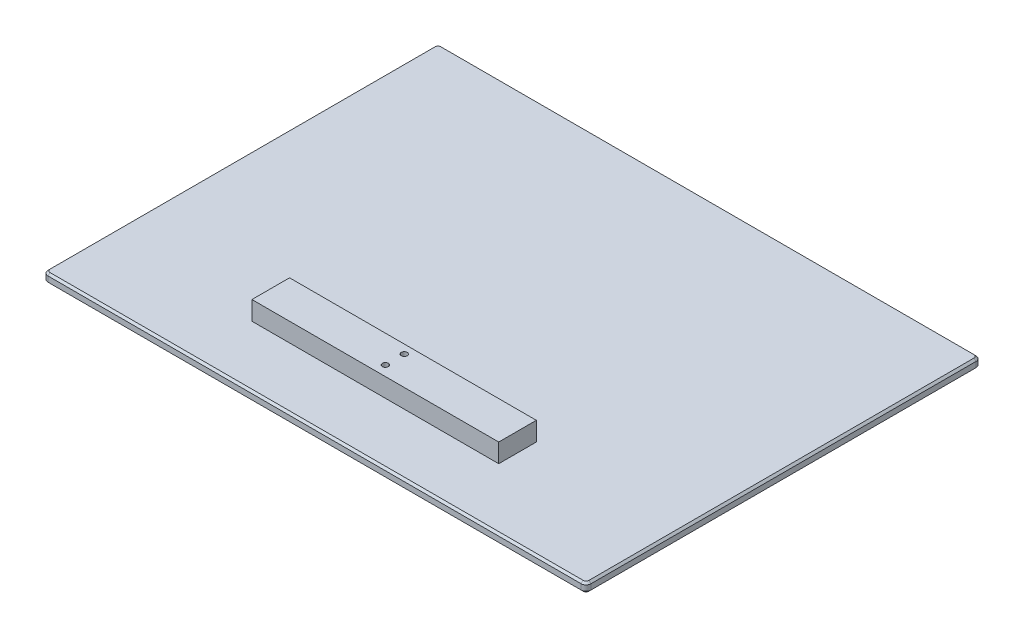
ISO-10303-21;
HEADER;
FILE_DESCRIPTION(('STEP AP214'),'2;1');
FILE_NAME('part.step','',(''),(''),'','','');
FILE_SCHEMA(('AUTOMOTIVE_DESIGN { 1 0 10303 214 1 1 1 1 }'));
ENDSEC;
DATA;
#1=APPLICATION_CONTEXT('core data for automotive mechanical design processes');
#2=APPLICATION_PROTOCOL_DEFINITION('international standard','automotive_design',2000,#1);
#3=PRODUCT_CONTEXT('',#1,'mechanical');
#4=PRODUCT('Part','Part','',(#3));
#5=PRODUCT_RELATED_PRODUCT_CATEGORY('part','',(#4));
#6=PRODUCT_DEFINITION_FORMATION('','',#4);
#7=PRODUCT_DEFINITION_CONTEXT('part definition',#1,'design');
#8=PRODUCT_DEFINITION('design','',#6,#7);
#9=PRODUCT_DEFINITION_SHAPE('','',#8);
#10=(LENGTH_UNIT() NAMED_UNIT(*) SI_UNIT(.MILLI.,.METRE.));
#11=(NAMED_UNIT(*) PLANE_ANGLE_UNIT() SI_UNIT($,.RADIAN.));
#12=(NAMED_UNIT(*) SI_UNIT($,.STERADIAN.) SOLID_ANGLE_UNIT());
#13=UNCERTAINTY_MEASURE_WITH_UNIT(LENGTH_MEASURE(1.E-05),#10,'distance_accuracy_value','');
#14=(GEOMETRIC_REPRESENTATION_CONTEXT(3) GLOBAL_UNCERTAINTY_ASSIGNED_CONTEXT((#13)) GLOBAL_UNIT_ASSIGNED_CONTEXT((#10,
#11,#12)) REPRESENTATION_CONTEXT('',''));
#15=CARTESIAN_POINT('',(0.,0.,0.));
#16=DIRECTION('',(0.,0.,1.));
#17=DIRECTION('',(1.,0.,0.));
#18=AXIS2_PLACEMENT_3D('',#15,#16,#17);
#19=CARTESIAN_POINT('',(275.,9.525,-200.));
#20=DIRECTION('',(-1.,0.,0.));
#21=DIRECTION('',(0.,0.,1.));
#22=AXIS2_PLACEMENT_3D('',#19,#20,#21);
#23=PLANE('',#22);
#24=DIRECTION('',(0.,-1.,0.));
#25=VECTOR('',#24,1.);
#26=CARTESIAN_POINT('',(275.,9.525,195.));
#27=LINE('',#26,#25);
#28=CARTESIAN_POINT('',(275.,7.52500000000005,195.));
#29=VERTEX_POINT('',#28);
#30=CARTESIAN_POINT('',(275.,1.99999999999995,195.));
#31=VERTEX_POINT('',#30);
#32=EDGE_CURVE('E216',#29,#31,#27,.T.);
#33=ORIENTED_EDGE('',*,*,#32,.T.);
#34=DIRECTION('',(0.,0.,-1.));
#35=VECTOR('',#34,1.);
#36=CARTESIAN_POINT('',(275.,1.99999999999995,-200.));
#37=LINE('',#36,#35);
#38=CARTESIAN_POINT('',(275.,1.99999999999995,-195.));
#39=VERTEX_POINT('',#38);
#40=EDGE_CURVE('E311',#31,#39,#37,.T.);
#41=ORIENTED_EDGE('',*,*,#40,.T.);
#42=DIRECTION('',(0.,-1.,0.));
#43=VECTOR('',#42,1.);
#44=CARTESIAN_POINT('',(275.,9.525,-195.));
#45=LINE('',#44,#43);
#46=CARTESIAN_POINT('',(275.,7.52500000000005,-195.));
#47=VERTEX_POINT('',#46);
#48=EDGE_CURVE('E219',#39,#47,#45,.F.);
#49=ORIENTED_EDGE('',*,*,#48,.T.);
#50=DIRECTION('',(0.,0.,1.));
#51=VECTOR('',#50,1.);
#52=CARTESIAN_POINT('',(275.,7.52500000000005,195.));
#53=LINE('',#52,#51);
#54=EDGE_CURVE('E253',#47,#29,#53,.T.);
#55=ORIENTED_EDGE('',*,*,#54,.T.);
#56=EDGE_LOOP('',(#33,#41,#49,#55));
#57=FACE_BOUND('',#56,.T.);
#58=ADVANCED_FACE('F34',(#57),#23,.F.);
#59=CARTESIAN_POINT('',(-275.,9.525,-200.));
#60=DIRECTION('',(0.,0.,1.));
#61=DIRECTION('',(1.,0.,0.));
#62=AXIS2_PLACEMENT_3D('',#59,#60,#61);
#63=PLANE('',#62);
#64=DIRECTION('',(0.,-1.,0.));
#65=VECTOR('',#64,1.);
#66=CARTESIAN_POINT('',(270.,9.525,-200.));
#67=LINE('',#66,#65);
#68=CARTESIAN_POINT('',(270.,7.52500000000005,-200.));
#69=VERTEX_POINT('',#68);
#70=CARTESIAN_POINT('',(270.,1.99999999999995,-200.));
#71=VERTEX_POINT('',#70);
#72=EDGE_CURVE('E211',#69,#71,#67,.T.);
#73=ORIENTED_EDGE('',*,*,#72,.T.);
#74=DIRECTION('',(-1.,0.,0.));
#75=VECTOR('',#74,1.);
#76=CARTESIAN_POINT('',(-275.,1.99999999999995,-200.));
#77=LINE('',#76,#75);
#78=CARTESIAN_POINT('',(-270.,1.99999999999995,-200.));
#79=VERTEX_POINT('',#78);
#80=EDGE_CURVE('E263',#71,#79,#77,.T.);
#81=ORIENTED_EDGE('',*,*,#80,.T.);
#82=DIRECTION('',(0.,-1.,0.));
#83=VECTOR('',#82,1.);
#84=CARTESIAN_POINT('',(-270.,9.525,-200.));
#85=LINE('',#84,#83);
#86=CARTESIAN_POINT('',(-270.,7.52500000000005,-200.));
#87=VERTEX_POINT('',#86);
#88=EDGE_CURVE('E214',#79,#87,#85,.F.);
#89=ORIENTED_EDGE('',*,*,#88,.T.);
#90=DIRECTION('',(1.,0.,0.));
#91=VECTOR('',#90,1.);
#92=CARTESIAN_POINT('',(270.,7.52500000000005,-200.));
#93=LINE('',#92,#91);
#94=EDGE_CURVE('E242',#87,#69,#93,.T.);
#95=ORIENTED_EDGE('',*,*,#94,.T.);
#96=EDGE_LOOP('',(#73,#81,#89,#95));
#97=FACE_BOUND('',#96,.T.);
#98=ADVANCED_FACE('F360',(#97),#63,.F.);
#99=CARTESIAN_POINT('',(-275.,9.525,-200.));
#100=DIRECTION('',(1.,0.,0.));
#101=DIRECTION('',(0.,0.,-1.));
#102=AXIS2_PLACEMENT_3D('',#99,#100,#101);
#103=PLANE('',#102);
#104=DIRECTION('',(0.,-1.,0.));
#105=VECTOR('',#104,1.);
#106=CARTESIAN_POINT('',(-275.,9.525,-195.));
#107=LINE('',#106,#105);
#108=CARTESIAN_POINT('',(-275.,7.52500000000005,-195.));
#109=VERTEX_POINT('',#108);
#110=CARTESIAN_POINT('',(-275.,1.99999999999995,-195.));
#111=VERTEX_POINT('',#110);
#112=EDGE_CURVE('E207',#109,#111,#107,.T.);
#113=ORIENTED_EDGE('',*,*,#112,.T.);
#114=DIRECTION('',(0.,0.,1.));
#115=VECTOR('',#114,1.);
#116=CARTESIAN_POINT('',(-275.,1.99999999999995,-200.));
#117=LINE('',#116,#115);
#118=CARTESIAN_POINT('',(-275.,1.99999999999995,195.));
#119=VERTEX_POINT('',#118);
#120=EDGE_CURVE('E309',#111,#119,#117,.T.);
#121=ORIENTED_EDGE('',*,*,#120,.T.);
#122=DIRECTION('',(0.,-1.,0.));
#123=VECTOR('',#122,1.);
#124=CARTESIAN_POINT('',(-275.,9.525,195.));
#125=LINE('',#124,#123);
#126=CARTESIAN_POINT('',(-275.,7.52500000000005,195.));
#127=VERTEX_POINT('',#126);
#128=EDGE_CURVE('E205',#119,#127,#125,.F.);
#129=ORIENTED_EDGE('',*,*,#128,.T.);
#130=DIRECTION('',(0.,0.,-1.));
#131=VECTOR('',#130,1.);
#132=CARTESIAN_POINT('',(-275.,7.52500000000005,-195.));
#133=LINE('',#132,#131);
#134=EDGE_CURVE('E251',#127,#109,#133,.T.);
#135=ORIENTED_EDGE('',*,*,#134,.T.);
#136=EDGE_LOOP('',(#113,#121,#129,#135));
#137=FACE_BOUND('',#136,.T.);
#138=ADVANCED_FACE('F366',(#137),#103,.F.);
#139=CARTESIAN_POINT('',(-275.,9.525,200.));
#140=DIRECTION('',(0.,0.,-1.));
#141=DIRECTION('',(-1.,0.,0.));
#142=AXIS2_PLACEMENT_3D('',#139,#140,#141);
#143=PLANE('',#142);
#144=DIRECTION('',(0.,-1.,0.));
#145=VECTOR('',#144,1.);
#146=CARTESIAN_POINT('',(-270.,9.525,200.));
#147=LINE('',#146,#145);
#148=CARTESIAN_POINT('',(-270.,7.52500000000005,200.));
#149=VERTEX_POINT('',#148);
#150=CARTESIAN_POINT('',(-270.,1.99999999999995,200.));
#151=VERTEX_POINT('',#150);
#152=EDGE_CURVE('E221',#149,#151,#147,.T.);
#153=ORIENTED_EDGE('',*,*,#152,.T.);
#154=DIRECTION('',(1.,0.,0.));
#155=VECTOR('',#154,1.);
#156=CARTESIAN_POINT('',(-275.,1.99999999999995,200.));
#157=LINE('',#156,#155);
#158=CARTESIAN_POINT('',(270.,1.99999999999995,200.));
#159=VERTEX_POINT('',#158);
#160=EDGE_CURVE('E57',#151,#159,#157,.T.);
#161=ORIENTED_EDGE('',*,*,#160,.T.);
#162=DIRECTION('',(0.,-1.,0.));
#163=VECTOR('',#162,1.);
#164=CARTESIAN_POINT('',(270.,9.525,200.));
#165=LINE('',#164,#163);
#166=CARTESIAN_POINT('',(270.,7.52500000000005,200.));
#167=VERTEX_POINT('',#166);
#168=EDGE_CURVE('E223',#159,#167,#165,.F.);
#169=ORIENTED_EDGE('',*,*,#168,.T.);
#170=DIRECTION('',(-1.,0.,0.));
#171=VECTOR('',#170,1.);
#172=CARTESIAN_POINT('',(-270.,7.52500000000005,200.));
#173=LINE('',#172,#171);
#174=EDGE_CURVE('E261',#167,#149,#173,.T.);
#175=ORIENTED_EDGE('',*,*,#174,.T.);
#176=EDGE_LOOP('',(#153,#161,#169,#175));
#177=FACE_BOUND('',#176,.T.);
#178=ADVANCED_FACE('F357',(#177),#143,.F.);
#179=CARTESIAN_POINT('',(0.,9.525,0.));
#180=DIRECTION('',(0.,1.,0.));
#181=DIRECTION('',(0.,0.,1.));
#182=AXIS2_PLACEMENT_3D('',#179,#180,#181);
#183=PLANE('',#182);
#184=DIRECTION('',(1.,0.,0.));
#185=VECTOR('',#184,1.);
#186=CARTESIAN_POINT('',(-125.,9.525,138.45));
#187=LINE('',#186,#185);
#188=CARTESIAN_POINT('',(-125.,9.525,138.45));
#189=VERTEX_POINT('',#188);
#190=CARTESIAN_POINT('',(125.,9.525,138.45));
#191=VERTEX_POINT('',#190);
#192=EDGE_CURVE('E693',#189,#191,#187,.T.);
#193=ORIENTED_EDGE('',*,*,#192,.F.);
#194=DIRECTION('',(0.,0.,1.));
#195=VECTOR('',#194,1.);
#196=CARTESIAN_POINT('',(-125.,9.525,100.35));
#197=LINE('',#196,#195);
#198=CARTESIAN_POINT('',(-125.,9.525,100.35));
#199=VERTEX_POINT('',#198);
#200=EDGE_CURVE('E196',#199,#189,#197,.T.);
#201=ORIENTED_EDGE('',*,*,#200,.F.);
#202=DIRECTION('',(-1.,0.,0.));
#203=VECTOR('',#202,1.);
#204=CARTESIAN_POINT('',(-125.,9.525,100.35));
#205=LINE('',#204,#203);
#206=CARTESIAN_POINT('',(125.,9.525,100.35));
#207=VERTEX_POINT('',#206);
#208=EDGE_CURVE('E192',#207,#199,#205,.T.);
#209=ORIENTED_EDGE('',*,*,#208,.F.);
#210=DIRECTION('',(0.,0.,-1.));
#211=VECTOR('',#210,1.);
#212=CARTESIAN_POINT('',(125.,9.525,100.35));
#213=LINE('',#212,#211);
#214=EDGE_CURVE('E702',#191,#207,#213,.T.);
#215=ORIENTED_EDGE('',*,*,#214,.F.);
#216=EDGE_LOOP('',(#193,#201,#209,#215));
#217=FACE_BOUND('',#216,.T.);
#218=CARTESIAN_POINT('',(270.,9.525,-195.));
#219=DIRECTION('',(0.,1.,0.));
#220=DIRECTION('',(0.,0.,1.));
#221=AXIS2_PLACEMENT_3D('',#218,#219,#220);
#222=CIRCLE('',#221,3.);
#223=CARTESIAN_POINT('',(273.,9.525,-195.));
#224=VERTEX_POINT('',#223);
#225=CARTESIAN_POINT('',(270.,9.525,-198.));
#226=VERTEX_POINT('',#225);
#227=EDGE_CURVE('E235',#224,#226,#222,.T.);
#228=ORIENTED_EDGE('',*,*,#227,.T.);
#229=DIRECTION('',(-1.,0.,0.));
#230=VECTOR('',#229,1.);
#231=CARTESIAN_POINT('',(-270.,9.525,-198.));
#232=LINE('',#231,#230);
#233=CARTESIAN_POINT('',(-270.,9.525,-198.));
#234=VERTEX_POINT('',#233);
#235=EDGE_CURVE('E239',#226,#234,#232,.T.);
#236=ORIENTED_EDGE('',*,*,#235,.T.);
#237=CARTESIAN_POINT('',(-270.,9.525,-195.));
#238=DIRECTION('',(0.,1.,0.));
#239=DIRECTION('',(0.,0.,1.));
#240=AXIS2_PLACEMENT_3D('',#237,#238,#239);
#241=CIRCLE('',#240,3.);
#242=CARTESIAN_POINT('',(-273.,9.525,-195.));
#243=VERTEX_POINT('',#242);
#244=EDGE_CURVE('E237',#234,#243,#241,.T.);
#245=ORIENTED_EDGE('',*,*,#244,.T.);
#246=DIRECTION('',(0.,0.,1.));
#247=VECTOR('',#246,1.);
#248=CARTESIAN_POINT('',(-273.,9.525,195.));
#249=LINE('',#248,#247);
#250=CARTESIAN_POINT('',(-273.,9.525,195.));
#251=VERTEX_POINT('',#250);
#252=EDGE_CURVE('E233',#243,#251,#249,.T.);
#253=ORIENTED_EDGE('',*,*,#252,.T.);
#254=CARTESIAN_POINT('',(-270.,9.525,195.));
#255=DIRECTION('',(0.,1.,0.));
#256=DIRECTION('',(0.,0.,1.));
#257=AXIS2_PLACEMENT_3D('',#254,#255,#256);
#258=CIRCLE('',#257,3.);
#259=CARTESIAN_POINT('',(-270.,9.525,198.));
#260=VERTEX_POINT('',#259);
#261=EDGE_CURVE('E229',#251,#260,#258,.T.);
#262=ORIENTED_EDGE('',*,*,#261,.T.);
#263=DIRECTION('',(1.,0.,0.));
#264=VECTOR('',#263,1.);
#265=CARTESIAN_POINT('',(270.,9.525,198.));
#266=LINE('',#265,#264);
#267=CARTESIAN_POINT('',(270.,9.525,198.));
#268=VERTEX_POINT('',#267);
#269=EDGE_CURVE('E225',#260,#268,#266,.T.);
#270=ORIENTED_EDGE('',*,*,#269,.T.);
#271=CARTESIAN_POINT('',(270.,9.525,195.));
#272=DIRECTION('',(0.,1.,0.));
#273=DIRECTION('',(0.,0.,1.));
#274=AXIS2_PLACEMENT_3D('',#271,#272,#273);
#275=CIRCLE('',#274,3.);
#276=CARTESIAN_POINT('',(273.,9.525,195.));
#277=VERTEX_POINT('',#276);
#278=EDGE_CURVE('E227',#268,#277,#275,.T.);
#279=ORIENTED_EDGE('',*,*,#278,.T.);
#280=DIRECTION('',(0.,0.,-1.));
#281=VECTOR('',#280,1.);
#282=CARTESIAN_POINT('',(273.,9.525,-195.));
#283=LINE('',#282,#281);
#284=EDGE_CURVE('E231',#277,#224,#283,.T.);
#285=ORIENTED_EDGE('',*,*,#284,.T.);
#286=EDGE_LOOP('',(#228,#236,#245,#253,#262,#270,#279,#285));
#287=FACE_BOUND('',#286,.T.);
#288=ADVANCED_FACE('F344',(#217,#287),#183,.T.);
#289=CARTESIAN_POINT('',(0.,0.,0.));
#290=DIRECTION('',(0.,1.,0.));
#291=DIRECTION('',(0.,0.,1.));
#292=AXIS2_PLACEMENT_3D('',#289,#290,#291);
#293=PLANE('',#292);
#294=CARTESIAN_POINT('',(-270.,0.,-195.));
#295=DIRECTION('',(0.,1.,0.));
#296=DIRECTION('',(0.,0.,1.));
#297=AXIS2_PLACEMENT_3D('',#294,#295,#296);
#298=CIRCLE('',#297,3.);
#299=CARTESIAN_POINT('',(-273.,0.,-195.));
#300=VERTEX_POINT('',#299);
#301=CARTESIAN_POINT('',(-270.,0.,-198.));
#302=VERTEX_POINT('',#301);
#303=EDGE_CURVE('E300',#300,#302,#298,.F.);
#304=ORIENTED_EDGE('',*,*,#303,.T.);
#305=DIRECTION('',(1.,0.,0.));
#306=VECTOR('',#305,1.);
#307=CARTESIAN_POINT('',(0.,0.,-198.));
#308=LINE('',#307,#306);
#309=CARTESIAN_POINT('',(270.,0.,-198.));
#310=VERTEX_POINT('',#309);
#311=EDGE_CURVE('E302',#302,#310,#308,.T.);
#312=ORIENTED_EDGE('',*,*,#311,.T.);
#313=CARTESIAN_POINT('',(270.,0.,-195.));
#314=DIRECTION('',(0.,1.,0.));
#315=DIRECTION('',(0.,0.,1.));
#316=AXIS2_PLACEMENT_3D('',#313,#314,#315);
#317=CIRCLE('',#316,3.);
#318=CARTESIAN_POINT('',(273.,0.,-195.));
#319=VERTEX_POINT('',#318);
#320=EDGE_CURVE('E298',#310,#319,#317,.F.);
#321=ORIENTED_EDGE('',*,*,#320,.T.);
#322=DIRECTION('',(0.,0.,1.));
#323=VECTOR('',#322,1.);
#324=CARTESIAN_POINT('',(273.,0.,0.));
#325=LINE('',#324,#323);
#326=CARTESIAN_POINT('',(273.,0.,195.));
#327=VERTEX_POINT('',#326);
#328=EDGE_CURVE('E294',#319,#327,#325,.T.);
#329=ORIENTED_EDGE('',*,*,#328,.T.);
#330=CARTESIAN_POINT('',(270.,0.,195.));
#331=DIRECTION('',(0.,1.,0.));
#332=DIRECTION('',(0.,0.,1.));
#333=AXIS2_PLACEMENT_3D('',#330,#331,#332);
#334=CIRCLE('',#333,3.);
#335=CARTESIAN_POINT('',(270.,0.,198.));
#336=VERTEX_POINT('',#335);
#337=EDGE_CURVE('E290',#327,#336,#334,.F.);
#338=ORIENTED_EDGE('',*,*,#337,.T.);
#339=DIRECTION('',(-1.,0.,0.));
#340=VECTOR('',#339,1.);
#341=CARTESIAN_POINT('',(0.,0.,198.));
#342=LINE('',#341,#340);
#343=CARTESIAN_POINT('',(-270.,0.,198.));
#344=VERTEX_POINT('',#343);
#345=EDGE_CURVE('E288',#336,#344,#342,.T.);
#346=ORIENTED_EDGE('',*,*,#345,.T.);
#347=CARTESIAN_POINT('',(-270.,0.,195.));
#348=DIRECTION('',(0.,1.,0.));
#349=DIRECTION('',(0.,0.,1.));
#350=AXIS2_PLACEMENT_3D('',#347,#348,#349);
#351=CIRCLE('',#350,3.);
#352=CARTESIAN_POINT('',(-273.,0.,195.));
#353=VERTEX_POINT('',#352);
#354=EDGE_CURVE('E292',#344,#353,#351,.F.);
#355=ORIENTED_EDGE('',*,*,#354,.T.);
#356=DIRECTION('',(0.,0.,-1.));
#357=VECTOR('',#356,1.);
#358=CARTESIAN_POINT('',(-273.,0.,0.));
#359=LINE('',#358,#357);
#360=EDGE_CURVE('E296',#353,#300,#359,.T.);
#361=ORIENTED_EDGE('',*,*,#360,.T.);
#362=EDGE_LOOP('',(#304,#312,#321,#329,#338,#346,#355,#361));
#363=FACE_BOUND('',#362,.T.);
#364=ADVANCED_FACE('F356',(#363),#293,.F.);
#365=CARTESIAN_POINT('',(-270.,9.525,-195.));
#366=DIRECTION('',(0.,-1.,0.));
#367=DIRECTION('',(0.,0.,-1.));
#368=AXIS2_PLACEMENT_3D('',#365,#366,#367);
#369=CYLINDRICAL_SURFACE('',#368,5.);
#370=ORIENTED_EDGE('',*,*,#88,.F.);
#371=CARTESIAN_POINT('',(-270.,1.99999999999995,-195.));
#372=DIRECTION('',(0.,1.,0.));
#373=DIRECTION('',(0.,0.,1.));
#374=AXIS2_PLACEMENT_3D('',#371,#372,#373);
#375=CIRCLE('',#374,5.);
#376=EDGE_CURVE('E305',#79,#111,#375,.T.);
#377=ORIENTED_EDGE('',*,*,#376,.T.);
#378=ORIENTED_EDGE('',*,*,#112,.F.);
#379=CARTESIAN_POINT('',(-270.,7.52500000000005,-195.));
#380=DIRECTION('',(0.,1.,0.));
#381=DIRECTION('',(0.,0.,1.));
#382=AXIS2_PLACEMENT_3D('',#379,#380,#381);
#383=CIRCLE('',#382,5.);
#384=EDGE_CURVE('E245',#109,#87,#383,.F.);
#385=ORIENTED_EDGE('',*,*,#384,.T.);
#386=EDGE_LOOP('',(#370,#377,#378,#385));
#387=FACE_BOUND('',#386,.T.);
#388=ADVANCED_FACE('F371',(#387),#369,.T.);
#389=CARTESIAN_POINT('',(270.,9.525,-195.));
#390=DIRECTION('',(0.,-1.,0.));
#391=DIRECTION('',(0.,0.,-1.));
#392=AXIS2_PLACEMENT_3D('',#389,#390,#391);
#393=CYLINDRICAL_SURFACE('',#392,5.);
#394=ORIENTED_EDGE('',*,*,#48,.F.);
#395=CARTESIAN_POINT('',(270.,1.99999999999995,-195.));
#396=DIRECTION('',(0.,1.,0.));
#397=DIRECTION('',(0.,0.,1.));
#398=AXIS2_PLACEMENT_3D('',#395,#396,#397);
#399=CIRCLE('',#398,5.);
#400=EDGE_CURVE('E307',#39,#71,#399,.T.);
#401=ORIENTED_EDGE('',*,*,#400,.T.);
#402=ORIENTED_EDGE('',*,*,#72,.F.);
#403=CARTESIAN_POINT('',(270.,7.52500000000005,-195.));
#404=DIRECTION('',(0.,1.,0.));
#405=DIRECTION('',(0.,0.,1.));
#406=AXIS2_PLACEMENT_3D('',#403,#404,#405);
#407=CIRCLE('',#406,5.);
#408=EDGE_CURVE('E248',#69,#47,#407,.F.);
#409=ORIENTED_EDGE('',*,*,#408,.T.);
#410=EDGE_LOOP('',(#394,#401,#402,#409));
#411=FACE_BOUND('',#410,.T.);
#412=ADVANCED_FACE('F374',(#411),#393,.T.);
#413=CARTESIAN_POINT('',(270.,9.525,195.));
#414=DIRECTION('',(0.,-1.,0.));
#415=DIRECTION('',(0.,0.,-1.));
#416=AXIS2_PLACEMENT_3D('',#413,#414,#415);
#417=CYLINDRICAL_SURFACE('',#416,5.);
#418=ORIENTED_EDGE('',*,*,#168,.F.);
#419=CARTESIAN_POINT('',(270.,1.99999999999995,195.));
#420=DIRECTION('',(0.,1.,0.));
#421=DIRECTION('',(0.,0.,1.));
#422=AXIS2_PLACEMENT_3D('',#419,#420,#421);
#423=CIRCLE('',#422,5.);
#424=EDGE_CURVE('E315',#159,#31,#423,.T.);
#425=ORIENTED_EDGE('',*,*,#424,.T.);
#426=ORIENTED_EDGE('',*,*,#32,.F.);
#427=CARTESIAN_POINT('',(270.,7.52500000000005,195.));
#428=DIRECTION('',(0.,1.,0.));
#429=DIRECTION('',(0.,0.,1.));
#430=AXIS2_PLACEMENT_3D('',#427,#428,#429);
#431=CIRCLE('',#430,5.);
#432=EDGE_CURVE('E258',#29,#167,#431,.F.);
#433=ORIENTED_EDGE('',*,*,#432,.T.);
#434=EDGE_LOOP('',(#418,#425,#426,#433));
#435=FACE_BOUND('',#434,.T.);
#436=ADVANCED_FACE('F378',(#435),#417,.T.);
#437=CARTESIAN_POINT('',(-270.,9.525,195.));
#438=DIRECTION('',(0.,-1.,0.));
#439=DIRECTION('',(0.,0.,-1.));
#440=AXIS2_PLACEMENT_3D('',#437,#438,#439);
#441=CYLINDRICAL_SURFACE('',#440,5.);
#442=ORIENTED_EDGE('',*,*,#128,.F.);
#443=CARTESIAN_POINT('',(-270.,1.99999999999995,195.));
#444=DIRECTION('',(0.,1.,0.));
#445=DIRECTION('',(0.,0.,1.));
#446=AXIS2_PLACEMENT_3D('',#443,#444,#445);
#447=CIRCLE('',#446,5.);
#448=EDGE_CURVE('E313',#119,#151,#447,.T.);
#449=ORIENTED_EDGE('',*,*,#448,.T.);
#450=ORIENTED_EDGE('',*,*,#152,.F.);
#451=CARTESIAN_POINT('',(-270.,7.52500000000005,195.));
#452=DIRECTION('',(0.,1.,0.));
#453=DIRECTION('',(0.,0.,1.));
#454=AXIS2_PLACEMENT_3D('',#451,#452,#453);
#455=CIRCLE('',#454,5.);
#456=EDGE_CURVE('E255',#149,#127,#455,.F.);
#457=ORIENTED_EDGE('',*,*,#456,.T.);
#458=EDGE_LOOP('',(#442,#449,#450,#457));
#459=FACE_BOUND('',#458,.T.);
#460=ADVANCED_FACE('F382',(#459),#441,.T.);
#461=CARTESIAN_POINT('',(0.,9.525,198.));
#462=DIRECTION('',(0.,0.707106781186557,0.707106781186538));
#463=DIRECTION('',(-1.,0.,0.));
#464=AXIS2_PLACEMENT_3D('',#461,#462,#463);
#465=PLANE('',#464);
#466=DIRECTION('',(0.,0.707106781186538,-0.707106781186557));
#467=VECTOR('',#466,1.);
#468=CARTESIAN_POINT('',(-270.,7.52500000000005,200.));
#469=LINE('',#468,#467);
#470=EDGE_CURVE('E281',#149,#260,#469,.T.);
#471=ORIENTED_EDGE('',*,*,#470,.F.);
#472=ORIENTED_EDGE('',*,*,#174,.F.);
#473=DIRECTION('',(0.,-0.707106781186538,0.707106781186557));
#474=VECTOR('',#473,1.);
#475=CARTESIAN_POINT('',(270.,9.525,198.));
#476=LINE('',#475,#474);
#477=EDGE_CURVE('E208',#268,#167,#476,.T.);
#478=ORIENTED_EDGE('',*,*,#477,.F.);
#479=ORIENTED_EDGE('',*,*,#269,.F.);
#480=EDGE_LOOP('',(#471,#472,#478,#479));
#481=FACE_BOUND('',#480,.T.);
#482=ADVANCED_FACE('F386',(#481),#465,.T.);
#483=CARTESIAN_POINT('',(270.,9.525,195.));
#484=DIRECTION('',(0.,-1.,0.));
#485=DIRECTION('',(0.,0.,-1.));
#486=AXIS2_PLACEMENT_3D('',#483,#484,#485);
#487=CONICAL_SURFACE('',#486,3.,0.785398163397461);
#488=ORIENTED_EDGE('',*,*,#477,.T.);
#489=ORIENTED_EDGE('',*,*,#432,.F.);
#490=DIRECTION('',(0.707106781186557,-0.707106781186538,0.));
#491=VECTOR('',#490,1.);
#492=CARTESIAN_POINT('',(273.,9.525,195.));
#493=LINE('',#492,#491);
#494=EDGE_CURVE('E278',#277,#29,#493,.T.);
#495=ORIENTED_EDGE('',*,*,#494,.F.);
#496=ORIENTED_EDGE('',*,*,#278,.F.);
#497=EDGE_LOOP('',(#488,#489,#495,#496));
#498=FACE_BOUND('',#497,.T.);
#499=ADVANCED_FACE('F411',(#498),#487,.T.);
#500=CARTESIAN_POINT('',(-270.,9.525,195.));
#501=DIRECTION('',(0.,-1.,0.));
#502=DIRECTION('',(0.,0.,-1.));
#503=AXIS2_PLACEMENT_3D('',#500,#501,#502);
#504=CONICAL_SURFACE('',#503,3.,0.785398163397461);
#505=ORIENTED_EDGE('',*,*,#470,.T.);
#506=ORIENTED_EDGE('',*,*,#261,.F.);
#507=DIRECTION('',(0.707106781186557,0.707106781186538,0.));
#508=VECTOR('',#507,1.);
#509=CARTESIAN_POINT('',(-275.,7.52500000000005,195.));
#510=LINE('',#509,#508);
#511=EDGE_CURVE('E275',#127,#251,#510,.T.);
#512=ORIENTED_EDGE('',*,*,#511,.F.);
#513=ORIENTED_EDGE('',*,*,#456,.F.);
#514=EDGE_LOOP('',(#505,#506,#512,#513));
#515=FACE_BOUND('',#514,.T.);
#516=ADVANCED_FACE('F407',(#515),#504,.T.);
#517=CARTESIAN_POINT('',(273.,9.525,0.));
#518=DIRECTION('',(0.707106781186538,0.707106781186557,0.));
#519=DIRECTION('',(0.,0.,1.));
#520=AXIS2_PLACEMENT_3D('',#517,#518,#519);
#521=PLANE('',#520);
#522=ORIENTED_EDGE('',*,*,#494,.T.);
#523=ORIENTED_EDGE('',*,*,#54,.F.);
#524=DIRECTION('',(0.707106781186557,-0.707106781186538,0.));
#525=VECTOR('',#524,1.);
#526=CARTESIAN_POINT('',(273.,9.525,-195.));
#527=LINE('',#526,#525);
#528=EDGE_CURVE('E272',#224,#47,#527,.T.);
#529=ORIENTED_EDGE('',*,*,#528,.F.);
#530=ORIENTED_EDGE('',*,*,#284,.F.);
#531=EDGE_LOOP('',(#522,#523,#529,#530));
#532=FACE_BOUND('',#531,.T.);
#533=ADVANCED_FACE('F403',(#532),#521,.T.);
#534=CARTESIAN_POINT('',(-273.,9.525,0.));
#535=DIRECTION('',(-0.707106781186538,0.707106781186557,0.));
#536=DIRECTION('',(0.,0.,-1.));
#537=AXIS2_PLACEMENT_3D('',#534,#535,#536);
#538=PLANE('',#537);
#539=ORIENTED_EDGE('',*,*,#511,.T.);
#540=ORIENTED_EDGE('',*,*,#252,.F.);
#541=DIRECTION('',(0.707106781186557,0.707106781186538,0.));
#542=VECTOR('',#541,1.);
#543=CARTESIAN_POINT('',(-275.,7.52500000000005,-195.));
#544=LINE('',#543,#542);
#545=EDGE_CURVE('E269',#109,#243,#544,.T.);
#546=ORIENTED_EDGE('',*,*,#545,.F.);
#547=ORIENTED_EDGE('',*,*,#134,.F.);
#548=EDGE_LOOP('',(#539,#540,#546,#547));
#549=FACE_BOUND('',#548,.T.);
#550=ADVANCED_FACE('F399',(#549),#538,.T.);
#551=CARTESIAN_POINT('',(270.,9.525,-195.));
#552=DIRECTION('',(0.,-1.,0.));
#553=DIRECTION('',(0.,0.,-1.));
#554=AXIS2_PLACEMENT_3D('',#551,#552,#553);
#555=CONICAL_SURFACE('',#554,3.,0.785398163397461);
#556=ORIENTED_EDGE('',*,*,#528,.T.);
#557=ORIENTED_EDGE('',*,*,#408,.F.);
#558=DIRECTION('',(0.,-0.707106781186538,-0.707106781186557));
#559=VECTOR('',#558,1.);
#560=CARTESIAN_POINT('',(270.,9.525,-198.));
#561=LINE('',#560,#559);
#562=EDGE_CURVE('E266',#226,#69,#561,.T.);
#563=ORIENTED_EDGE('',*,*,#562,.F.);
#564=ORIENTED_EDGE('',*,*,#227,.F.);
#565=EDGE_LOOP('',(#556,#557,#563,#564));
#566=FACE_BOUND('',#565,.T.);
#567=ADVANCED_FACE('F395',(#566),#555,.T.);
#568=CARTESIAN_POINT('',(-270.,9.525,-195.));
#569=DIRECTION('',(0.,-1.,0.));
#570=DIRECTION('',(0.,0.,-1.));
#571=AXIS2_PLACEMENT_3D('',#568,#569,#570);
#572=CONICAL_SURFACE('',#571,3.,0.785398163397461);
#573=ORIENTED_EDGE('',*,*,#545,.T.);
#574=ORIENTED_EDGE('',*,*,#244,.F.);
#575=DIRECTION('',(0.,0.707106781186538,0.707106781186557));
#576=VECTOR('',#575,1.);
#577=CARTESIAN_POINT('',(-270.,7.52500000000005,-200.));
#578=LINE('',#577,#576);
#579=EDGE_CURVE('E264',#87,#234,#578,.T.);
#580=ORIENTED_EDGE('',*,*,#579,.F.);
#581=ORIENTED_EDGE('',*,*,#384,.F.);
#582=EDGE_LOOP('',(#573,#574,#580,#581));
#583=FACE_BOUND('',#582,.T.);
#584=ADVANCED_FACE('F391',(#583),#572,.T.);
#585=CARTESIAN_POINT('',(0.,9.525,-198.));
#586=DIRECTION('',(0.,0.707106781186557,-0.707106781186538));
#587=DIRECTION('',(1.,0.,0.));
#588=AXIS2_PLACEMENT_3D('',#585,#586,#587);
#589=PLANE('',#588);
#590=ORIENTED_EDGE('',*,*,#562,.T.);
#591=ORIENTED_EDGE('',*,*,#94,.F.);
#592=ORIENTED_EDGE('',*,*,#579,.T.);
#593=ORIENTED_EDGE('',*,*,#235,.F.);
#594=EDGE_LOOP('',(#590,#591,#592,#593));
#595=FACE_BOUND('',#594,.T.);
#596=ADVANCED_FACE('F388',(#595),#589,.T.);
#597=CARTESIAN_POINT('',(-275.,1.99999999999995,200.));
#598=DIRECTION('',(0.,0.707106781186557,-0.707106781186538));
#599=DIRECTION('',(1.,0.,0.));
#600=AXIS2_PLACEMENT_3D('',#597,#598,#599);
#601=PLANE('',#600);
#602=DIRECTION('',(0.,0.707106781186538,0.707106781186557));
#603=VECTOR('',#602,1.);
#604=CARTESIAN_POINT('',(-270.,0.,198.));
#605=LINE('',#604,#603);
#606=EDGE_CURVE('E331',#344,#151,#605,.T.);
#607=ORIENTED_EDGE('',*,*,#606,.F.);
#608=ORIENTED_EDGE('',*,*,#345,.F.);
#609=DIRECTION('',(0.,-0.707106781186538,-0.707106781186557));
#610=VECTOR('',#609,1.);
#611=CARTESIAN_POINT('',(270.,1.99999999999995,200.));
#612=LINE('',#611,#610);
#613=EDGE_CURVE('E267',#159,#336,#612,.T.);
#614=ORIENTED_EDGE('',*,*,#613,.F.);
#615=ORIENTED_EDGE('',*,*,#160,.F.);
#616=EDGE_LOOP('',(#607,#608,#614,#615));
#617=FACE_BOUND('',#616,.T.);
#618=ADVANCED_FACE('F36',(#617),#601,.F.);
#619=CARTESIAN_POINT('',(270.,0.,195.));
#620=DIRECTION('',(0.,1.,0.));
#621=DIRECTION('',(0.,0.,1.));
#622=AXIS2_PLACEMENT_3D('',#619,#620,#621);
#623=CONICAL_SURFACE('',#622,3.,0.785398163397461);
#624=ORIENTED_EDGE('',*,*,#613,.T.);
#625=ORIENTED_EDGE('',*,*,#337,.F.);
#626=DIRECTION('',(-0.707106781186557,-0.707106781186538,0.));
#627=VECTOR('',#626,1.);
#628=CARTESIAN_POINT('',(275.,1.99999999999995,195.));
#629=LINE('',#628,#627);
#630=EDGE_CURVE('E328',#31,#327,#629,.T.);
#631=ORIENTED_EDGE('',*,*,#630,.F.);
#632=ORIENTED_EDGE('',*,*,#424,.F.);
#633=EDGE_LOOP('',(#624,#625,#631,#632));
#634=FACE_BOUND('',#633,.T.);
#635=ADVANCED_FACE('F441',(#634),#623,.T.);
#636=CARTESIAN_POINT('',(-270.,0.,195.));
#637=DIRECTION('',(0.,1.,0.));
#638=DIRECTION('',(0.,0.,1.));
#639=AXIS2_PLACEMENT_3D('',#636,#637,#638);
#640=CONICAL_SURFACE('',#639,3.,0.785398163397461);
#641=ORIENTED_EDGE('',*,*,#606,.T.);
#642=ORIENTED_EDGE('',*,*,#448,.F.);
#643=DIRECTION('',(-0.707106781186557,0.707106781186538,0.));
#644=VECTOR('',#643,1.);
#645=CARTESIAN_POINT('',(-273.,0.,195.));
#646=LINE('',#645,#644);
#647=EDGE_CURVE('E325',#353,#119,#646,.T.);
#648=ORIENTED_EDGE('',*,*,#647,.F.);
#649=ORIENTED_EDGE('',*,*,#354,.F.);
#650=EDGE_LOOP('',(#641,#642,#648,#649));
#651=FACE_BOUND('',#650,.T.);
#652=ADVANCED_FACE('F438',(#651),#640,.T.);
#653=CARTESIAN_POINT('',(275.,1.99999999999995,-200.));
#654=DIRECTION('',(-0.707106781186538,0.707106781186557,0.));
#655=DIRECTION('',(0.,0.,-1.));
#656=AXIS2_PLACEMENT_3D('',#653,#654,#655);
#657=PLANE('',#656);
#658=ORIENTED_EDGE('',*,*,#630,.T.);
#659=ORIENTED_EDGE('',*,*,#328,.F.);
#660=DIRECTION('',(-0.707106781186557,-0.707106781186538,0.));
#661=VECTOR('',#660,1.);
#662=CARTESIAN_POINT('',(275.,1.99999999999995,-195.));
#663=LINE('',#662,#661);
#664=EDGE_CURVE('E322',#39,#319,#663,.T.);
#665=ORIENTED_EDGE('',*,*,#664,.F.);
#666=ORIENTED_EDGE('',*,*,#40,.F.);
#667=EDGE_LOOP('',(#658,#659,#665,#666));
#668=FACE_BOUND('',#667,.T.);
#669=ADVANCED_FACE('F434',(#668),#657,.F.);
#670=CARTESIAN_POINT('',(-275.,1.99999999999995,-200.));
#671=DIRECTION('',(0.707106781186538,0.707106781186557,0.));
#672=DIRECTION('',(0.,0.,1.));
#673=AXIS2_PLACEMENT_3D('',#670,#671,#672);
#674=PLANE('',#673);
#675=ORIENTED_EDGE('',*,*,#647,.T.);
#676=ORIENTED_EDGE('',*,*,#120,.F.);
#677=DIRECTION('',(-0.707106781186557,0.707106781186538,0.));
#678=VECTOR('',#677,1.);
#679=CARTESIAN_POINT('',(-273.,0.,-195.));
#680=LINE('',#679,#678);
#681=EDGE_CURVE('E319',#300,#111,#680,.T.);
#682=ORIENTED_EDGE('',*,*,#681,.F.);
#683=ORIENTED_EDGE('',*,*,#360,.F.);
#684=EDGE_LOOP('',(#675,#676,#682,#683));
#685=FACE_BOUND('',#684,.T.);
#686=ADVANCED_FACE('F430',(#685),#674,.F.);
#687=CARTESIAN_POINT('',(270.,0.,-195.));
#688=DIRECTION('',(0.,1.,0.));
#689=DIRECTION('',(0.,0.,1.));
#690=AXIS2_PLACEMENT_3D('',#687,#688,#689);
#691=CONICAL_SURFACE('',#690,3.,0.785398163397461);
#692=ORIENTED_EDGE('',*,*,#664,.T.);
#693=ORIENTED_EDGE('',*,*,#320,.F.);
#694=DIRECTION('',(0.,-0.707106781186538,0.707106781186557));
#695=VECTOR('',#694,1.);
#696=CARTESIAN_POINT('',(270.,1.99999999999995,-200.));
#697=LINE('',#696,#695);
#698=EDGE_CURVE('E200',#71,#310,#697,.T.);
#699=ORIENTED_EDGE('',*,*,#698,.F.);
#700=ORIENTED_EDGE('',*,*,#400,.F.);
#701=EDGE_LOOP('',(#692,#693,#699,#700));
#702=FACE_BOUND('',#701,.T.);
#703=ADVANCED_FACE('F426',(#702),#691,.T.);
#704=CARTESIAN_POINT('',(-270.,0.,-195.));
#705=DIRECTION('',(0.,1.,0.));
#706=DIRECTION('',(0.,0.,1.));
#707=AXIS2_PLACEMENT_3D('',#704,#705,#706);
#708=CONICAL_SURFACE('',#707,3.,0.785398163397461);
#709=ORIENTED_EDGE('',*,*,#681,.T.);
#710=ORIENTED_EDGE('',*,*,#376,.F.);
#711=DIRECTION('',(0.,0.707106781186538,-0.707106781186557));
#712=VECTOR('',#711,1.);
#713=CARTESIAN_POINT('',(-270.,0.,-198.));
#714=LINE('',#713,#712);
#715=EDGE_CURVE('E198',#302,#79,#714,.T.);
#716=ORIENTED_EDGE('',*,*,#715,.F.);
#717=ORIENTED_EDGE('',*,*,#303,.F.);
#718=EDGE_LOOP('',(#709,#710,#716,#717));
#719=FACE_BOUND('',#718,.T.);
#720=ADVANCED_FACE('F422',(#719),#708,.T.);
#721=CARTESIAN_POINT('',(-275.,1.99999999999995,-200.));
#722=DIRECTION('',(0.,0.707106781186557,0.707106781186538));
#723=DIRECTION('',(-1.,0.,0.));
#724=AXIS2_PLACEMENT_3D('',#721,#722,#723);
#725=PLANE('',#724);
#726=ORIENTED_EDGE('',*,*,#698,.T.);
#727=ORIENTED_EDGE('',*,*,#311,.F.);
#728=ORIENTED_EDGE('',*,*,#715,.T.);
#729=ORIENTED_EDGE('',*,*,#80,.F.);
#730=EDGE_LOOP('',(#726,#727,#728,#729));
#731=FACE_BOUND('',#730,.T.);
#732=ADVANCED_FACE('F419',(#731),#725,.F.);
#733=CARTESIAN_POINT('',(0.,28.575,0.));
#734=DIRECTION('',(0.,1.,0.));
#735=DIRECTION('',(0.,0.,1.));
#736=AXIS2_PLACEMENT_3D('',#733,#734,#735);
#737=PLANE('',#736);
#738=CARTESIAN_POINT('',(0.,28.575,109.15));
#739=DIRECTION('',(0.,1.,0.));
#740=DIRECTION('',(0.,0.,1.));
#741=AXIS2_PLACEMENT_3D('',#738,#739,#740);
#742=CIRCLE('',#741,3.);
#743=CARTESIAN_POINT('',(0.,28.575,112.15));
#744=VERTEX_POINT('',#743);
#745=EDGE_CURVE('E689',#744,#744,#742,.T.);
#746=ORIENTED_EDGE('',*,*,#745,.F.);
#747=EDGE_LOOP('',(#746));
#748=FACE_BOUND('',#747,.T.);
#749=DIRECTION('',(0.,0.,1.));
#750=VECTOR('',#749,1.);
#751=CARTESIAN_POINT('',(-125.,28.575,100.35));
#752=LINE('',#751,#750);
#753=CARTESIAN_POINT('',(-125.,28.575,100.35));
#754=VERTEX_POINT('',#753);
#755=CARTESIAN_POINT('',(-125.,28.575,138.45));
#756=VERTEX_POINT('',#755);
#757=EDGE_CURVE('E183',#754,#756,#752,.T.);
#758=ORIENTED_EDGE('',*,*,#757,.T.);
#759=DIRECTION('',(1.,0.,0.));
#760=VECTOR('',#759,1.);
#761=CARTESIAN_POINT('',(-125.,28.575,138.45));
#762=LINE('',#761,#760);
#763=CARTESIAN_POINT('',(125.,28.575,138.45));
#764=VERTEX_POINT('',#763);
#765=EDGE_CURVE('E172',#756,#764,#762,.T.);
#766=ORIENTED_EDGE('',*,*,#765,.T.);
#767=DIRECTION('',(0.,0.,-1.));
#768=VECTOR('',#767,1.);
#769=CARTESIAN_POINT('',(125.,28.575,100.35));
#770=LINE('',#769,#768);
#771=CARTESIAN_POINT('',(125.,28.575,100.35));
#772=VERTEX_POINT('',#771);
#773=EDGE_CURVE('E182',#764,#772,#770,.T.);
#774=ORIENTED_EDGE('',*,*,#773,.T.);
#775=DIRECTION('',(-1.,0.,0.));
#776=VECTOR('',#775,1.);
#777=CARTESIAN_POINT('',(-125.,28.575,100.35));
#778=LINE('',#777,#776);
#779=EDGE_CURVE('E188',#772,#754,#778,.T.);
#780=ORIENTED_EDGE('',*,*,#779,.T.);
#781=EDGE_LOOP('',(#758,#766,#774,#780));
#782=FACE_BOUND('',#781,.T.);
#783=CARTESIAN_POINT('',(0.,28.575,128.25));
#784=DIRECTION('',(0.,1.,0.));
#785=DIRECTION('',(0.,0.,1.));
#786=AXIS2_PLACEMENT_3D('',#783,#784,#785);
#787=CIRCLE('',#786,3.);
#788=CARTESIAN_POINT('',(0.,28.575,131.25));
#789=VERTEX_POINT('',#788);
#790=EDGE_CURVE('E691',#789,#789,#787,.T.);
#791=ORIENTED_EDGE('',*,*,#790,.F.);
#792=EDGE_LOOP('',(#791));
#793=FACE_BOUND('',#792,.T.);
#794=ADVANCED_FACE('F186',(#748,#782,#793),#737,.T.);
#795=CARTESIAN_POINT('',(-125.,28.575,100.35));
#796=DIRECTION('',(1.,0.,0.));
#797=DIRECTION('',(0.,0.,-1.));
#798=AXIS2_PLACEMENT_3D('',#795,#796,#797);
#799=PLANE('',#798);
#800=ORIENTED_EDGE('',*,*,#200,.T.);
#801=DIRECTION('',(0.,-1.,0.));
#802=VECTOR('',#801,1.);
#803=CARTESIAN_POINT('',(-125.,28.575,138.45));
#804=LINE('',#803,#802);
#805=EDGE_CURVE('E176',#756,#189,#804,.T.);
#806=ORIENTED_EDGE('',*,*,#805,.F.);
#807=ORIENTED_EDGE('',*,*,#757,.F.);
#808=DIRECTION('',(0.,-1.,0.));
#809=VECTOR('',#808,1.);
#810=CARTESIAN_POINT('',(-125.,28.575,100.35));
#811=LINE('',#810,#809);
#812=EDGE_CURVE('E699',#754,#199,#811,.T.);
#813=ORIENTED_EDGE('',*,*,#812,.T.);
#814=EDGE_LOOP('',(#800,#806,#807,#813));
#815=FACE_BOUND('',#814,.T.);
#816=ADVANCED_FACE('F194',(#815),#799,.F.);
#817=CARTESIAN_POINT('',(-125.,28.575,138.45));
#818=DIRECTION('',(0.,0.,-1.));
#819=DIRECTION('',(-1.,0.,0.));
#820=AXIS2_PLACEMENT_3D('',#817,#818,#819);
#821=PLANE('',#820);
#822=ORIENTED_EDGE('',*,*,#192,.T.);
#823=DIRECTION('',(0.,-1.,0.));
#824=VECTOR('',#823,1.);
#825=CARTESIAN_POINT('',(125.,28.575,138.45));
#826=LINE('',#825,#824);
#827=EDGE_CURVE('E179',#764,#191,#826,.T.);
#828=ORIENTED_EDGE('',*,*,#827,.F.);
#829=ORIENTED_EDGE('',*,*,#765,.F.);
#830=ORIENTED_EDGE('',*,*,#805,.T.);
#831=EDGE_LOOP('',(#822,#828,#829,#830));
#832=FACE_BOUND('',#831,.T.);
#833=ADVANCED_FACE('F174',(#832),#821,.F.);
#834=CARTESIAN_POINT('',(125.,28.575,100.35));
#835=DIRECTION('',(-1.,0.,0.));
#836=DIRECTION('',(0.,0.,1.));
#837=AXIS2_PLACEMENT_3D('',#834,#835,#836);
#838=PLANE('',#837);
#839=ORIENTED_EDGE('',*,*,#214,.T.);
#840=DIRECTION('',(0.,-1.,0.));
#841=VECTOR('',#840,1.);
#842=CARTESIAN_POINT('',(125.,28.575,100.35));
#843=LINE('',#842,#841);
#844=EDGE_CURVE('E49',#772,#207,#843,.T.);
#845=ORIENTED_EDGE('',*,*,#844,.F.);
#846=ORIENTED_EDGE('',*,*,#773,.F.);
#847=ORIENTED_EDGE('',*,*,#827,.T.);
#848=EDGE_LOOP('',(#839,#845,#846,#847));
#849=FACE_BOUND('',#848,.T.);
#850=ADVANCED_FACE('F641',(#849),#838,.F.);
#851=CARTESIAN_POINT('',(-125.,28.575,100.35));
#852=DIRECTION('',(0.,0.,1.));
#853=DIRECTION('',(1.,0.,0.));
#854=AXIS2_PLACEMENT_3D('',#851,#852,#853);
#855=PLANE('',#854);
#856=ORIENTED_EDGE('',*,*,#208,.T.);
#857=ORIENTED_EDGE('',*,*,#812,.F.);
#858=ORIENTED_EDGE('',*,*,#779,.F.);
#859=ORIENTED_EDGE('',*,*,#844,.T.);
#860=EDGE_LOOP('',(#856,#857,#858,#859));
#861=FACE_BOUND('',#860,.T.);
#862=ADVANCED_FACE('F650',(#861),#855,.F.);
#863=CARTESIAN_POINT('',(0.,28.575,109.15));
#864=DIRECTION('',(0.,-1.,0.));
#865=DIRECTION('',(0.,0.,-1.));
#866=AXIS2_PLACEMENT_3D('',#863,#864,#865);
#867=CYLINDRICAL_SURFACE('',#866,3.);
#868=ORIENTED_EDGE('',*,*,#745,.T.);
#869=EDGE_LOOP('',(#868));
#870=FACE_BOUND('',#869,.T.);
#871=CARTESIAN_POINT('',(0.,9.525,109.15));
#872=DIRECTION('',(0.,1.,0.));
#873=DIRECTION('',(0.,0.,1.));
#874=AXIS2_PLACEMENT_3D('',#871,#872,#873);
#875=CIRCLE('',#874,3.);
#876=CARTESIAN_POINT('',(0.,9.525,112.15));
#877=VERTEX_POINT('',#876);
#878=EDGE_CURVE('E11',#877,#877,#875,.F.);
#879=ORIENTED_EDGE('',*,*,#878,.T.);
#880=EDGE_LOOP('',(#879));
#881=FACE_BOUND('',#880,.T.);
#882=ADVANCED_FACE('F350',(#870,#881),#867,.F.);
#883=CARTESIAN_POINT('',(0.,28.575,128.25));
#884=DIRECTION('',(0.,-1.,0.));
#885=DIRECTION('',(0.,0.,-1.));
#886=AXIS2_PLACEMENT_3D('',#883,#884,#885);
#887=CYLINDRICAL_SURFACE('',#886,3.);
#888=ORIENTED_EDGE('',*,*,#790,.T.);
#889=EDGE_LOOP('',(#888));
#890=FACE_BOUND('',#889,.T.);
#891=CARTESIAN_POINT('',(0.,9.525,128.25));
#892=DIRECTION('',(0.,1.,0.));
#893=DIRECTION('',(0.,0.,1.));
#894=AXIS2_PLACEMENT_3D('',#891,#892,#893);
#895=CIRCLE('',#894,3.);
#896=CARTESIAN_POINT('',(0.,9.525,131.25));
#897=VERTEX_POINT('',#896);
#898=EDGE_CURVE('E42',#897,#897,#895,.F.);
#899=ORIENTED_EDGE('',*,*,#898,.T.);
#900=EDGE_LOOP('',(#899));
#901=FACE_BOUND('',#900,.T.);
#902=ADVANCED_FACE('F338',(#890,#901),#887,.F.);
#903=ORIENTED_EDGE('',*,*,#898,.F.);
#904=EDGE_LOOP('',(#903));
#905=FACE_BOUND('',#904,.T.);
#906=ADVANCED_FACE('F340',(#905),#183,.T.);
#907=ORIENTED_EDGE('',*,*,#878,.F.);
#908=EDGE_LOOP('',(#907));
#909=FACE_BOUND('',#908,.T.);
#910=ADVANCED_FACE('F342',(#909),#183,.T.);
#911=CLOSED_SHELL('',(#58,#98,#138,#178,#288,#364,#388,#412,#436,#460,#482,#499,#516,#533,#550,
#567,#584,#596,#618,#635,#652,#669,#686,#703,#720,#732,#794,#816,#833,#850,#862,#882,#902,#906,#910));
#912=MANIFOLD_SOLID_BREP('B2',#911);
#913=ADVANCED_BREP_SHAPE_REPRESENTATION('',(#18,#912),#14);
#914=SHAPE_DEFINITION_REPRESENTATION(#9,#913);
ENDSEC;
END-ISO-10303-21;
